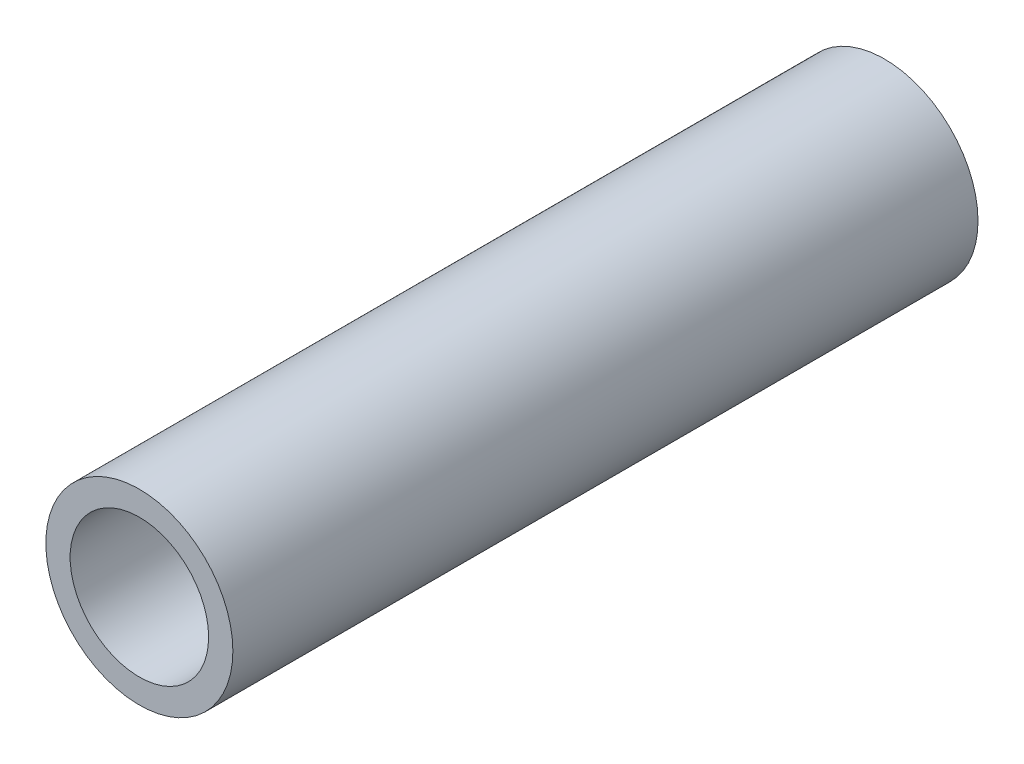
ISO-10303-21;
HEADER;
FILE_DESCRIPTION(('STEP AP214'),'2;1');
FILE_NAME('part.step','',(''),(''),'','','');
FILE_SCHEMA(('AUTOMOTIVE_DESIGN { 1 0 10303 214 1 1 1 1 }'));
ENDSEC;
DATA;
#1=APPLICATION_CONTEXT('core data for automotive mechanical design processes');
#2=APPLICATION_PROTOCOL_DEFINITION('international standard','automotive_design',2000,#1);
#3=PRODUCT_CONTEXT('',#1,'mechanical');
#4=PRODUCT('Part','Part','',(#3));
#5=PRODUCT_RELATED_PRODUCT_CATEGORY('part','',(#4));
#6=PRODUCT_DEFINITION_FORMATION('','',#4);
#7=PRODUCT_DEFINITION_CONTEXT('part definition',#1,'design');
#8=PRODUCT_DEFINITION('design','',#6,#7);
#9=PRODUCT_DEFINITION_SHAPE('','',#8);
#10=(LENGTH_UNIT() NAMED_UNIT(*) SI_UNIT(.MILLI.,.METRE.));
#11=(NAMED_UNIT(*) PLANE_ANGLE_UNIT() SI_UNIT($,.RADIAN.));
#12=(NAMED_UNIT(*) SI_UNIT($,.STERADIAN.) SOLID_ANGLE_UNIT());
#13=UNCERTAINTY_MEASURE_WITH_UNIT(LENGTH_MEASURE(1.E-05),#10,'distance_accuracy_value','');
#14=(GEOMETRIC_REPRESENTATION_CONTEXT(3) GLOBAL_UNCERTAINTY_ASSIGNED_CONTEXT((#13)) GLOBAL_UNIT_ASSIGNED_CONTEXT((#10,
#11,#12)) REPRESENTATION_CONTEXT('',''));
#15=CARTESIAN_POINT('',(0.,0.,0.));
#16=DIRECTION('',(0.,0.,1.));
#17=DIRECTION('',(1.,0.,0.));
#18=AXIS2_PLACEMENT_3D('',#15,#16,#17);
#19=CARTESIAN_POINT('',(0.,0.,42.5));
#20=DIRECTION('',(0.,0.,1.));
#21=DIRECTION('',(1.,0.,0.));
#22=AXIS2_PLACEMENT_3D('',#19,#20,#21);
#23=PLANE('',#22);
#24=CARTESIAN_POINT('',(0.,0.,42.5));
#25=DIRECTION('',(0.,0.,1.));
#26=DIRECTION('',(1.,0.,0.));
#27=AXIS2_PLACEMENT_3D('',#24,#25,#26);
#28=CIRCLE('',#27,10.668);
#29=CARTESIAN_POINT('',(10.668,0.,42.5));
#30=VERTEX_POINT('',#29);
#31=EDGE_CURVE('E11',#30,#30,#28,.T.);
#32=ORIENTED_EDGE('',*,*,#31,.T.);
#33=EDGE_LOOP('',(#32));
#34=FACE_BOUND('',#33,.T.);
#35=CARTESIAN_POINT('',(0.,0.,42.5));
#36=DIRECTION('',(0.,0.,1.));
#37=DIRECTION('',(1.,0.,0.));
#38=AXIS2_PLACEMENT_3D('',#35,#36,#37);
#39=CIRCLE('',#38,7.8994);
#40=CARTESIAN_POINT('',(7.8994,0.,42.5));
#41=VERTEX_POINT('',#40);
#42=EDGE_CURVE('E48',#41,#41,#39,.T.);
#43=ORIENTED_EDGE('',*,*,#42,.F.);
#44=EDGE_LOOP('',(#43));
#45=FACE_BOUND('',#44,.T.);
#46=ADVANCED_FACE('F37',(#34,#45),#23,.T.);
#47=CARTESIAN_POINT('',(0.,0.,-42.5));
#48=DIRECTION('',(0.,0.,1.));
#49=DIRECTION('',(1.,0.,0.));
#50=AXIS2_PLACEMENT_3D('',#47,#48,#49);
#51=PLANE('',#50);
#52=CARTESIAN_POINT('',(0.,0.,-42.5));
#53=DIRECTION('',(0.,0.,1.));
#54=DIRECTION('',(1.,0.,0.));
#55=AXIS2_PLACEMENT_3D('',#52,#53,#54);
#56=CIRCLE('',#55,10.668);
#57=CARTESIAN_POINT('',(10.668,0.,-42.5));
#58=VERTEX_POINT('',#57);
#59=EDGE_CURVE('E41',#58,#58,#56,.T.);
#60=ORIENTED_EDGE('',*,*,#59,.F.);
#61=EDGE_LOOP('',(#60));
#62=FACE_BOUND('',#61,.T.);
#63=CARTESIAN_POINT('',(0.,0.,-42.5));
#64=DIRECTION('',(0.,0.,1.));
#65=DIRECTION('',(1.,0.,0.));
#66=AXIS2_PLACEMENT_3D('',#63,#64,#65);
#67=CIRCLE('',#66,7.8994);
#68=CARTESIAN_POINT('',(7.8994,0.,-42.5));
#69=VERTEX_POINT('',#68);
#70=EDGE_CURVE('E50',#69,#69,#67,.T.);
#71=ORIENTED_EDGE('',*,*,#70,.T.);
#72=EDGE_LOOP('',(#71));
#73=FACE_BOUND('',#72,.T.);
#74=ADVANCED_FACE('F60',(#62,#73),#51,.F.);
#75=CARTESIAN_POINT('',(0.,0.,42.5));
#76=DIRECTION('',(0.,0.,-1.));
#77=DIRECTION('',(-1.,0.,0.));
#78=AXIS2_PLACEMENT_3D('',#75,#76,#77);
#79=CYLINDRICAL_SURFACE('',#78,10.668);
#80=ORIENTED_EDGE('',*,*,#31,.F.);
#81=EDGE_LOOP('',(#80));
#82=FACE_BOUND('',#81,.T.);
#83=ORIENTED_EDGE('',*,*,#59,.T.);
#84=EDGE_LOOP('',(#83));
#85=FACE_BOUND('',#84,.T.);
#86=ADVANCED_FACE('F39',(#82,#85),#79,.T.);
#87=CARTESIAN_POINT('',(0.,0.,42.5));
#88=DIRECTION('',(0.,0.,-1.));
#89=DIRECTION('',(-1.,0.,0.));
#90=AXIS2_PLACEMENT_3D('',#87,#88,#89);
#91=CYLINDRICAL_SURFACE('',#90,7.8994);
#92=ORIENTED_EDGE('',*,*,#42,.T.);
#93=EDGE_LOOP('',(#92));
#94=FACE_BOUND('',#93,.T.);
#95=ORIENTED_EDGE('',*,*,#70,.F.);
#96=EDGE_LOOP('',(#95));
#97=FACE_BOUND('',#96,.T.);
#98=ADVANCED_FACE('F56',(#94,#97),#91,.F.);
#99=CLOSED_SHELL('',(#46,#74,#86,#98));
#100=MANIFOLD_SOLID_BREP('B2',#99);
#101=ADVANCED_BREP_SHAPE_REPRESENTATION('',(#18,#100),#14);
#102=SHAPE_DEFINITION_REPRESENTATION(#9,#101);
ENDSEC;
END-ISO-10303-21;
